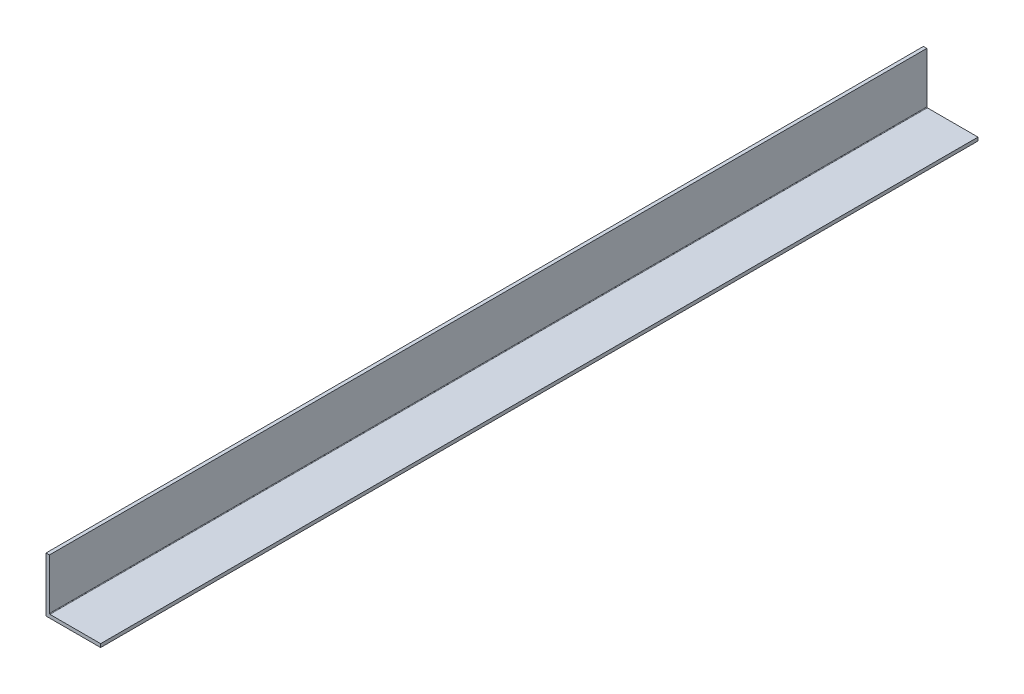
ISO-10303-21;
HEADER;
FILE_DESCRIPTION(('STEP AP214'),'2;1');
FILE_NAME('part.step','',(''),(''),'','','');
FILE_SCHEMA(('AUTOMOTIVE_DESIGN { 1 0 10303 214 1 1 1 1 }'));
ENDSEC;
DATA;
#1=APPLICATION_CONTEXT('core data for automotive mechanical design processes');
#2=APPLICATION_PROTOCOL_DEFINITION('international standard','automotive_design',2000,#1);
#3=PRODUCT_CONTEXT('',#1,'mechanical');
#4=PRODUCT('Part','Part','',(#3));
#5=PRODUCT_RELATED_PRODUCT_CATEGORY('part','',(#4));
#6=PRODUCT_DEFINITION_FORMATION('','',#4);
#7=PRODUCT_DEFINITION_CONTEXT('part definition',#1,'design');
#8=PRODUCT_DEFINITION('design','',#6,#7);
#9=PRODUCT_DEFINITION_SHAPE('','',#8);
#10=(LENGTH_UNIT() NAMED_UNIT(*) SI_UNIT(.MILLI.,.METRE.));
#11=(NAMED_UNIT(*) PLANE_ANGLE_UNIT() SI_UNIT($,.RADIAN.));
#12=(NAMED_UNIT(*) SI_UNIT($,.STERADIAN.) SOLID_ANGLE_UNIT());
#13=UNCERTAINTY_MEASURE_WITH_UNIT(LENGTH_MEASURE(1.E-05),#10,'distance_accuracy_value','');
#14=(GEOMETRIC_REPRESENTATION_CONTEXT(3) GLOBAL_UNCERTAINTY_ASSIGNED_CONTEXT((#13)) GLOBAL_UNIT_ASSIGNED_CONTEXT((#10,
#11,#12)) REPRESENTATION_CONTEXT('',''));
#15=CARTESIAN_POINT('',(0.,0.,0.));
#16=DIRECTION('',(0.,0.,1.));
#17=DIRECTION('',(1.,0.,0.));
#18=AXIS2_PLACEMENT_3D('',#15,#16,#17);
#19=CARTESIAN_POINT('',(1.5875,1.5875,304.8));
#20=DIRECTION('',(-1.,0.,0.));
#21=DIRECTION('',(0.,0.,1.));
#22=AXIS2_PLACEMENT_3D('',#19,#20,#21);
#23=PLANE('',#22);
#24=DIRECTION('',(0.,0.,-1.));
#25=VECTOR('',#24,1.);
#26=CARTESIAN_POINT('',(1.5875,1.8415,-304.8));
#27=LINE('',#26,#25);
#28=CARTESIAN_POINT('',(1.5875,1.8415,304.8));
#29=VERTEX_POINT('',#28);
#30=CARTESIAN_POINT('',(1.5875,1.8415,-103.1875));
#31=VERTEX_POINT('',#30);
#32=EDGE_CURVE('E133',#29,#31,#27,.T.);
#33=ORIENTED_EDGE('',*,*,#32,.T.);
#34=DIRECTION('',(0.,-1.,0.));
#35=VECTOR('',#34,1.);
#36=CARTESIAN_POINT('',(1.5875,25.4,-103.1875));
#37=LINE('',#36,#35);
#38=CARTESIAN_POINT('',(1.5875,25.4,-103.1875));
#39=VERTEX_POINT('',#38);
#40=EDGE_CURVE('E60',#39,#31,#37,.T.);
#41=ORIENTED_EDGE('',*,*,#40,.F.);
#42=DIRECTION('',(0.,0.,-1.));
#43=VECTOR('',#42,1.);
#44=CARTESIAN_POINT('',(1.5875,25.4,304.8));
#45=LINE('',#44,#43);
#46=CARTESIAN_POINT('',(1.5875,25.4,304.8));
#47=VERTEX_POINT('',#46);
#48=EDGE_CURVE('E122',#47,#39,#45,.T.);
#49=ORIENTED_EDGE('',*,*,#48,.F.);
#50=DIRECTION('',(0.,1.,0.));
#51=VECTOR('',#50,1.);
#52=CARTESIAN_POINT('',(1.5875,1.5875,304.8));
#53=LINE('',#52,#51);
#54=EDGE_CURVE('E124',#29,#47,#53,.T.);
#55=ORIENTED_EDGE('',*,*,#54,.F.);
#56=EDGE_LOOP('',(#33,#41,#49,#55));
#57=FACE_BOUND('',#56,.T.);
#58=ADVANCED_FACE('F44',(#57),#23,.F.);
#59=CARTESIAN_POINT('',(1.5875,25.4,304.8));
#60=DIRECTION('',(0.,-1.,0.));
#61=DIRECTION('',(0.,0.,-1.));
#62=AXIS2_PLACEMENT_3D('',#59,#60,#61);
#63=PLANE('',#62);
#64=ORIENTED_EDGE('',*,*,#48,.T.);
#65=DIRECTION('',(1.,0.,0.));
#66=VECTOR('',#65,1.);
#67=CARTESIAN_POINT('',(0.,25.4,-103.1875));
#68=LINE('',#67,#66);
#69=CARTESIAN_POINT('',(0.,25.4,-103.1875));
#70=VERTEX_POINT('',#69);
#71=EDGE_CURVE('E105',#70,#39,#68,.T.);
#72=ORIENTED_EDGE('',*,*,#71,.F.);
#73=DIRECTION('',(0.,0.,-1.));
#74=VECTOR('',#73,1.);
#75=CARTESIAN_POINT('',(0.,25.4,304.8));
#76=LINE('',#75,#74);
#77=CARTESIAN_POINT('',(0.,25.4,304.8));
#78=VERTEX_POINT('',#77);
#79=EDGE_CURVE('E119',#78,#70,#76,.T.);
#80=ORIENTED_EDGE('',*,*,#79,.F.);
#81=DIRECTION('',(-1.,0.,0.));
#82=VECTOR('',#81,1.);
#83=CARTESIAN_POINT('',(1.5875,25.4,304.8));
#84=LINE('',#83,#82);
#85=EDGE_CURVE('E160',#47,#78,#84,.T.);
#86=ORIENTED_EDGE('',*,*,#85,.F.);
#87=EDGE_LOOP('',(#64,#72,#80,#86));
#88=FACE_BOUND('',#87,.T.);
#89=ADVANCED_FACE('F117',(#88),#63,.F.);
#90=CARTESIAN_POINT('',(0.,25.4,304.8));
#91=DIRECTION('',(1.,0.,0.));
#92=DIRECTION('',(0.,1.,0.));
#93=AXIS2_PLACEMENT_3D('',#90,#91,#92);
#94=PLANE('',#93);
#95=ORIENTED_EDGE('',*,*,#79,.T.);
#96=DIRECTION('',(0.,1.,0.));
#97=VECTOR('',#96,1.);
#98=CARTESIAN_POINT('',(0.,0.,-103.1875));
#99=LINE('',#98,#97);
#100=CARTESIAN_POINT('',(0.,0.,-103.1875));
#101=VERTEX_POINT('',#100);
#102=EDGE_CURVE('E102',#101,#70,#99,.T.);
#103=ORIENTED_EDGE('',*,*,#102,.F.);
#104=DIRECTION('',(0.,0.,-1.));
#105=VECTOR('',#104,1.);
#106=CARTESIAN_POINT('',(0.,0.,304.8));
#107=LINE('',#106,#105);
#108=CARTESIAN_POINT('',(0.,0.,304.8));
#109=VERTEX_POINT('',#108);
#110=EDGE_CURVE('E129',#109,#101,#107,.T.);
#111=ORIENTED_EDGE('',*,*,#110,.F.);
#112=DIRECTION('',(0.,-1.,0.));
#113=VECTOR('',#112,1.);
#114=CARTESIAN_POINT('',(0.,25.4,304.8));
#115=LINE('',#114,#113);
#116=EDGE_CURVE('E127',#78,#109,#115,.T.);
#117=ORIENTED_EDGE('',*,*,#116,.F.);
#118=EDGE_LOOP('',(#95,#103,#111,#117));
#119=FACE_BOUND('',#118,.T.);
#120=ADVANCED_FACE('F126',(#119),#94,.F.);
#121=CARTESIAN_POINT('',(0.,0.,304.8));
#122=DIRECTION('',(0.,1.,0.));
#123=DIRECTION('',(0.,0.,1.));
#124=AXIS2_PLACEMENT_3D('',#121,#122,#123);
#125=PLANE('',#124);
#126=ORIENTED_EDGE('',*,*,#110,.T.);
#127=DIRECTION('',(-1.,0.,0.));
#128=VECTOR('',#127,1.);
#129=CARTESIAN_POINT('',(25.4,0.,-103.1875));
#130=LINE('',#129,#128);
#131=CARTESIAN_POINT('',(25.4,0.,-103.1875));
#132=VERTEX_POINT('',#131);
#133=EDGE_CURVE('E107',#132,#101,#130,.T.);
#134=ORIENTED_EDGE('',*,*,#133,.F.);
#135=DIRECTION('',(0.,0.,-1.));
#136=VECTOR('',#135,1.);
#137=CARTESIAN_POINT('',(25.4,0.,304.8));
#138=LINE('',#137,#136);
#139=CARTESIAN_POINT('',(25.4,0.,304.8));
#140=VERTEX_POINT('',#139);
#141=EDGE_CURVE('E135',#140,#132,#138,.T.);
#142=ORIENTED_EDGE('',*,*,#141,.F.);
#143=DIRECTION('',(1.,0.,0.));
#144=VECTOR('',#143,1.);
#145=CARTESIAN_POINT('',(0.,0.,304.8));
#146=LINE('',#145,#144);
#147=EDGE_CURVE('E165',#109,#140,#146,.T.);
#148=ORIENTED_EDGE('',*,*,#147,.F.);
#149=EDGE_LOOP('',(#126,#134,#142,#148));
#150=FACE_BOUND('',#149,.T.);
#151=ADVANCED_FACE('F187',(#150),#125,.F.);
#152=CARTESIAN_POINT('',(25.4,0.,304.8));
#153=DIRECTION('',(-1.,0.,0.));
#154=DIRECTION('',(0.,0.,1.));
#155=AXIS2_PLACEMENT_3D('',#152,#153,#154);
#156=PLANE('',#155);
#157=ORIENTED_EDGE('',*,*,#141,.T.);
#158=DIRECTION('',(0.,-1.,0.));
#159=VECTOR('',#158,1.);
#160=CARTESIAN_POINT('',(25.4,1.5875,-103.1875));
#161=LINE('',#160,#159);
#162=CARTESIAN_POINT('',(25.4,1.5875,-103.1875));
#163=VERTEX_POINT('',#162);
#164=EDGE_CURVE('E153',#163,#132,#161,.T.);
#165=ORIENTED_EDGE('',*,*,#164,.F.);
#166=DIRECTION('',(0.,0.,-1.));
#167=VECTOR('',#166,1.);
#168=CARTESIAN_POINT('',(25.4,1.5875,304.8));
#169=LINE('',#168,#167);
#170=CARTESIAN_POINT('',(25.4,1.5875,304.8));
#171=VERTEX_POINT('',#170);
#172=EDGE_CURVE('E174',#171,#163,#169,.T.);
#173=ORIENTED_EDGE('',*,*,#172,.F.);
#174=DIRECTION('',(0.,1.,0.));
#175=VECTOR('',#174,1.);
#176=CARTESIAN_POINT('',(25.4,0.,304.8));
#177=LINE('',#176,#175);
#178=EDGE_CURVE('E168',#140,#171,#177,.T.);
#179=ORIENTED_EDGE('',*,*,#178,.F.);
#180=EDGE_LOOP('',(#157,#165,#173,#179));
#181=FACE_BOUND('',#180,.T.);
#182=ADVANCED_FACE('F183',(#181),#156,.F.);
#183=CARTESIAN_POINT('',(25.4,1.5875,304.8));
#184=DIRECTION('',(0.,-1.,0.));
#185=DIRECTION('',(1.,0.,0.));
#186=AXIS2_PLACEMENT_3D('',#183,#184,#185);
#187=PLANE('',#186);
#188=ORIENTED_EDGE('',*,*,#172,.T.);
#189=DIRECTION('',(1.,0.,0.));
#190=VECTOR('',#189,1.);
#191=CARTESIAN_POINT('',(1.8415,1.5875,-103.1875));
#192=LINE('',#191,#190);
#193=CARTESIAN_POINT('',(1.8415,1.5875,-103.1875));
#194=VERTEX_POINT('',#193);
#195=EDGE_CURVE('E149',#194,#163,#192,.T.);
#196=ORIENTED_EDGE('',*,*,#195,.F.);
#197=DIRECTION('',(0.,0.,-1.));
#198=VECTOR('',#197,1.);
#199=CARTESIAN_POINT('',(1.8415,1.5875,304.8));
#200=LINE('',#199,#198);
#201=CARTESIAN_POINT('',(1.8415,1.5875,304.8));
#202=VERTEX_POINT('',#201);
#203=EDGE_CURVE('E53',#194,#202,#200,.F.);
#204=ORIENTED_EDGE('',*,*,#203,.T.);
#205=DIRECTION('',(-1.,0.,0.));
#206=VECTOR('',#205,1.);
#207=CARTESIAN_POINT('',(25.4,1.5875,304.8));
#208=LINE('',#207,#206);
#209=EDGE_CURVE('E171',#171,#202,#208,.T.);
#210=ORIENTED_EDGE('',*,*,#209,.F.);
#211=EDGE_LOOP('',(#188,#196,#204,#210));
#212=FACE_BOUND('',#211,.T.);
#213=ADVANCED_FACE('F191',(#212),#187,.F.);
#214=CARTESIAN_POINT('',(0.,0.,304.8));
#215=DIRECTION('',(0.,0.,1.));
#216=DIRECTION('',(1.,0.,0.));
#217=AXIS2_PLACEMENT_3D('',#214,#215,#216);
#218=PLANE('',#217);
#219=ORIENTED_EDGE('',*,*,#209,.T.);
#220=CARTESIAN_POINT('',(1.8415,1.8415,304.8));
#221=DIRECTION('',(0.,0.,1.));
#222=DIRECTION('',(1.,0.,0.));
#223=AXIS2_PLACEMENT_3D('',#220,#221,#222);
#224=CIRCLE('',#223,0.254);
#225=EDGE_CURVE('E12',#202,#29,#224,.F.);
#226=ORIENTED_EDGE('',*,*,#225,.T.);
#227=ORIENTED_EDGE('',*,*,#54,.T.);
#228=ORIENTED_EDGE('',*,*,#85,.T.);
#229=ORIENTED_EDGE('',*,*,#116,.T.);
#230=ORIENTED_EDGE('',*,*,#147,.T.);
#231=ORIENTED_EDGE('',*,*,#178,.T.);
#232=EDGE_LOOP('',(#219,#226,#227,#228,#229,#230,#231));
#233=FACE_BOUND('',#232,.T.);
#234=ADVANCED_FACE('F193',(#233),#218,.T.);
#235=CARTESIAN_POINT('',(1.8415,1.8415,304.8));
#236=DIRECTION('',(0.,0.,1.));
#237=DIRECTION('',(1.,0.,0.));
#238=AXIS2_PLACEMENT_3D('',#235,#236,#237);
#239=CYLINDRICAL_SURFACE('',#238,0.254);
#240=ORIENTED_EDGE('',*,*,#203,.F.);
#241=CARTESIAN_POINT('',(1.8415,1.8415,-103.1875));
#242=DIRECTION('',(0.,0.,1.));
#243=DIRECTION('',(1.,0.,0.));
#244=AXIS2_PLACEMENT_3D('',#241,#242,#243);
#245=CIRCLE('',#244,0.254);
#246=EDGE_CURVE('E147',#31,#194,#245,.T.);
#247=ORIENTED_EDGE('',*,*,#246,.F.);
#248=ORIENTED_EDGE('',*,*,#32,.F.);
#249=ORIENTED_EDGE('',*,*,#225,.F.);
#250=EDGE_LOOP('',(#240,#247,#248,#249));
#251=FACE_BOUND('',#250,.T.);
#252=ADVANCED_FACE('F46',(#251),#239,.F.);
#253=CARTESIAN_POINT('',(0.,0.,-103.1875));
#254=DIRECTION('',(0.,0.,1.));
#255=DIRECTION('',(1.,0.,0.));
#256=AXIS2_PLACEMENT_3D('',#253,#254,#255);
#257=PLANE('',#256);
#258=ORIENTED_EDGE('',*,*,#71,.T.);
#259=ORIENTED_EDGE('',*,*,#40,.T.);
#260=ORIENTED_EDGE('',*,*,#246,.T.);
#261=ORIENTED_EDGE('',*,*,#195,.T.);
#262=ORIENTED_EDGE('',*,*,#164,.T.);
#263=ORIENTED_EDGE('',*,*,#133,.T.);
#264=ORIENTED_EDGE('',*,*,#102,.T.);
#265=EDGE_LOOP('',(#258,#259,#260,#261,#262,#263,#264));
#266=FACE_BOUND('',#265,.T.);
#267=ADVANCED_FACE('F104',(#266),#257,.F.);
#268=CLOSED_SHELL('',(#58,#89,#120,#151,#182,#213,#234,#252,#267));
#269=MANIFOLD_SOLID_BREP('B2',#268);
#270=ADVANCED_BREP_SHAPE_REPRESENTATION('',(#18,#269),#14);
#271=SHAPE_DEFINITION_REPRESENTATION(#9,#270);
ENDSEC;
END-ISO-10303-21;
